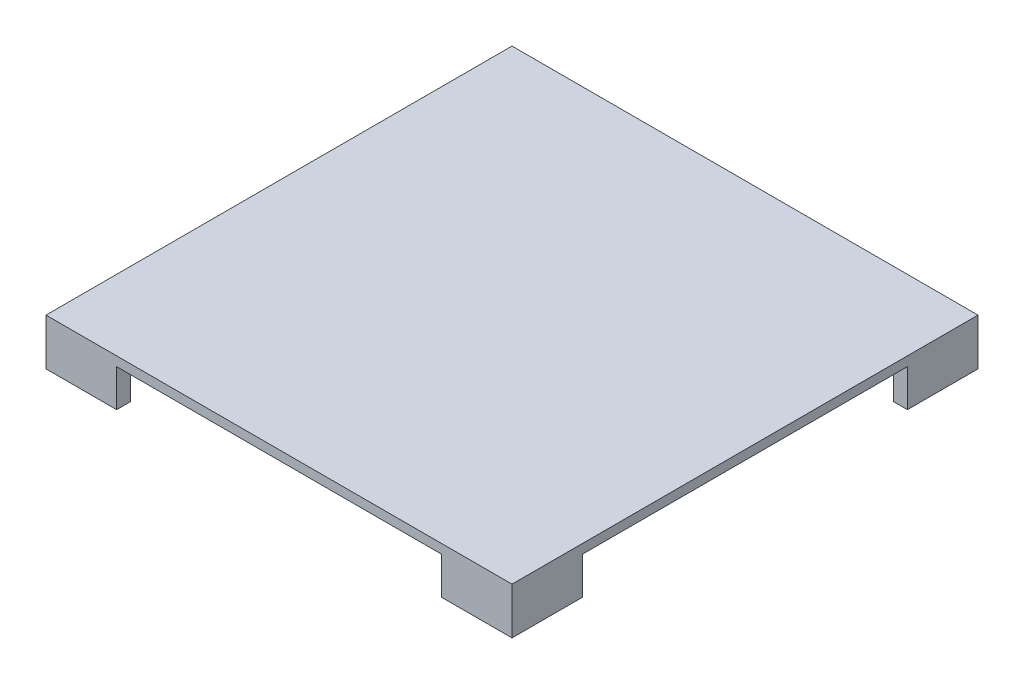
ISO-10303-21;
HEADER;
FILE_DESCRIPTION(('STEP AP214'),'2;1');
FILE_NAME('part.step','',(''),(''),'','','');
FILE_SCHEMA(('AUTOMOTIVE_DESIGN { 1 0 10303 214 1 1 1 1 }'));
ENDSEC;
DATA;
#1=APPLICATION_CONTEXT('core data for automotive mechanical design processes');
#2=APPLICATION_PROTOCOL_DEFINITION('international standard','automotive_design',2000,#1);
#3=PRODUCT_CONTEXT('',#1,'mechanical');
#4=PRODUCT('Part','Part','',(#3));
#5=PRODUCT_RELATED_PRODUCT_CATEGORY('part','',(#4));
#6=PRODUCT_DEFINITION_FORMATION('','',#4);
#7=PRODUCT_DEFINITION_CONTEXT('part definition',#1,'design');
#8=PRODUCT_DEFINITION('design','',#6,#7);
#9=PRODUCT_DEFINITION_SHAPE('','',#8);
#10=(LENGTH_UNIT() NAMED_UNIT(*) SI_UNIT(.MILLI.,.METRE.));
#11=(NAMED_UNIT(*) PLANE_ANGLE_UNIT() SI_UNIT($,.RADIAN.));
#12=(NAMED_UNIT(*) SI_UNIT($,.STERADIAN.) SOLID_ANGLE_UNIT());
#13=UNCERTAINTY_MEASURE_WITH_UNIT(LENGTH_MEASURE(1.E-05),#10,'distance_accuracy_value','');
#14=(GEOMETRIC_REPRESENTATION_CONTEXT(3) GLOBAL_UNCERTAINTY_ASSIGNED_CONTEXT((#13)) GLOBAL_UNIT_ASSIGNED_CONTEXT((#10,
#11,#12)) REPRESENTATION_CONTEXT('',''));
#15=CARTESIAN_POINT('',(0.,0.,0.));
#16=DIRECTION('',(0.,0.,1.));
#17=DIRECTION('',(1.,0.,0.));
#18=AXIS2_PLACEMENT_3D('',#15,#16,#17);
#19=CARTESIAN_POINT('',(0.,0.,0.));
#20=DIRECTION('',(0.,1.,0.));
#21=DIRECTION('',(0.,0.,1.));
#22=AXIS2_PLACEMENT_3D('',#19,#20,#21);
#23=PLANE('',#22);
#24=DIRECTION('',(0.,0.,-1.));
#25=VECTOR('',#24,1.);
#26=CARTESIAN_POINT('',(174.250613401321,0.,0.));
#27=LINE('',#26,#25);
#28=CARTESIAN_POINT('',(174.250613401321,0.,250.));
#29=VERTEX_POINT('',#28);
#30=CARTESIAN_POINT('',(174.250613401321,0.,235.));
#31=VERTEX_POINT('',#30);
#32=EDGE_CURVE('E231',#29,#31,#27,.T.);
#33=ORIENTED_EDGE('',*,*,#32,.F.);
#34=DIRECTION('',(1.,0.,0.));
#35=VECTOR('',#34,1.);
#36=CARTESIAN_POINT('',(0.,0.,250.));
#37=LINE('',#36,#35);
#38=CARTESIAN_POINT('',(-174.250613401321,0.,250.));
#39=VERTEX_POINT('',#38);
#40=EDGE_CURVE('E201',#39,#29,#37,.T.);
#41=ORIENTED_EDGE('',*,*,#40,.F.);
#42=DIRECTION('',(0.,0.,-1.));
#43=VECTOR('',#42,1.);
#44=CARTESIAN_POINT('',(-174.250613401321,0.,0.));
#45=LINE('',#44,#43);
#46=CARTESIAN_POINT('',(-174.250613401321,0.,235.));
#47=VERTEX_POINT('',#46);
#48=EDGE_CURVE('E303',#39,#47,#45,.T.);
#49=ORIENTED_EDGE('',*,*,#48,.T.);
#50=DIRECTION('',(1.,0.,0.));
#51=VECTOR('',#50,1.);
#52=CARTESIAN_POINT('',(1.07368331350599E-13,0.,235.));
#53=LINE('',#52,#51);
#54=CARTESIAN_POINT('',(-235.000000000002,0.,235.));
#55=VERTEX_POINT('',#54);
#56=EDGE_CURVE('E305',#55,#47,#53,.T.);
#57=ORIENTED_EDGE('',*,*,#56,.F.);
#58=DIRECTION('',(0.,0.,-1.));
#59=VECTOR('',#58,1.);
#60=CARTESIAN_POINT('',(-235.000000000002,0.,0.));
#61=LINE('',#60,#59);
#62=CARTESIAN_POINT('',(-235.000000000002,0.,174.250613401319));
#63=VERTEX_POINT('',#62);
#64=EDGE_CURVE('E287',#55,#63,#61,.T.);
#65=ORIENTED_EDGE('',*,*,#64,.T.);
#66=DIRECTION('',(1.,0.,0.));
#67=VECTOR('',#66,1.);
#68=CARTESIAN_POINT('',(0.,0.,174.250613401319));
#69=LINE('',#68,#67);
#70=CARTESIAN_POINT('',(-250.000000000002,0.,174.250613401319));
#71=VERTEX_POINT('',#70);
#72=EDGE_CURVE('E272',#71,#63,#69,.T.);
#73=ORIENTED_EDGE('',*,*,#72,.F.);
#74=DIRECTION('',(0.,0.,-1.));
#75=VECTOR('',#74,1.);
#76=CARTESIAN_POINT('',(-250.000000000002,0.,0.));
#77=LINE('',#76,#75);
#78=CARTESIAN_POINT('',(-250.000000000002,0.,-174.250613401319));
#79=VERTEX_POINT('',#78);
#80=EDGE_CURVE('E366',#71,#79,#77,.T.);
#81=ORIENTED_EDGE('',*,*,#80,.T.);
#82=DIRECTION('',(1.,0.,0.));
#83=VECTOR('',#82,1.);
#84=CARTESIAN_POINT('',(0.,0.,-174.250613401319));
#85=LINE('',#84,#83);
#86=CARTESIAN_POINT('',(-235.000000000002,0.,-174.250613401319));
#87=VERTEX_POINT('',#86);
#88=EDGE_CURVE('E58',#79,#87,#85,.T.);
#89=ORIENTED_EDGE('',*,*,#88,.T.);
#90=DIRECTION('',(0.,0.,1.));
#91=VECTOR('',#90,1.);
#92=CARTESIAN_POINT('',(-235.000000000002,0.,0.));
#93=LINE('',#92,#91);
#94=CARTESIAN_POINT('',(-235.000000000002,0.,-235.));
#95=VERTEX_POINT('',#94);
#96=EDGE_CURVE('E240',#95,#87,#93,.T.);
#97=ORIENTED_EDGE('',*,*,#96,.F.);
#98=DIRECTION('',(1.,0.,0.));
#99=VECTOR('',#98,1.);
#100=CARTESIAN_POINT('',(1.07368331350599E-13,0.,-235.));
#101=LINE('',#100,#99);
#102=CARTESIAN_POINT('',(-174.250613401321,0.,-235.));
#103=VERTEX_POINT('',#102);
#104=EDGE_CURVE('E264',#95,#103,#101,.T.);
#105=ORIENTED_EDGE('',*,*,#104,.T.);
#106=DIRECTION('',(0.,0.,1.));
#107=VECTOR('',#106,1.);
#108=CARTESIAN_POINT('',(-174.250613401321,0.,0.));
#109=LINE('',#108,#107);
#110=CARTESIAN_POINT('',(-174.250613401321,0.,-250.));
#111=VERTEX_POINT('',#110);
#112=EDGE_CURVE('E266',#111,#103,#109,.T.);
#113=ORIENTED_EDGE('',*,*,#112,.F.);
#114=DIRECTION('',(1.,0.,0.));
#115=VECTOR('',#114,1.);
#116=CARTESIAN_POINT('',(0.,0.,-250.));
#117=LINE('',#116,#115);
#118=CARTESIAN_POINT('',(174.250613401321,0.,-250.));
#119=VERTEX_POINT('',#118);
#120=EDGE_CURVE('E378',#111,#119,#117,.T.);
#121=ORIENTED_EDGE('',*,*,#120,.T.);
#122=DIRECTION('',(0.,0.,1.));
#123=VECTOR('',#122,1.);
#124=CARTESIAN_POINT('',(174.250613401321,0.,0.));
#125=LINE('',#124,#123);
#126=CARTESIAN_POINT('',(174.250613401321,0.,-235.));
#127=VERTEX_POINT('',#126);
#128=EDGE_CURVE('E342',#119,#127,#125,.T.);
#129=ORIENTED_EDGE('',*,*,#128,.T.);
#130=DIRECTION('',(-1.,0.,0.));
#131=VECTOR('',#130,1.);
#132=CARTESIAN_POINT('',(-1.07368331350599E-13,0.,-235.));
#133=LINE('',#132,#131);
#134=CARTESIAN_POINT('',(235.000000000002,0.,-235.));
#135=VERTEX_POINT('',#134);
#136=EDGE_CURVE('E345',#135,#127,#133,.T.);
#137=ORIENTED_EDGE('',*,*,#136,.F.);
#138=DIRECTION('',(0.,0.,1.));
#139=VECTOR('',#138,1.);
#140=CARTESIAN_POINT('',(235.000000000002,0.,0.));
#141=LINE('',#140,#139);
#142=CARTESIAN_POINT('',(235.000000000002,0.,-174.250613401319));
#143=VERTEX_POINT('',#142);
#144=EDGE_CURVE('E326',#135,#143,#141,.T.);
#145=ORIENTED_EDGE('',*,*,#144,.T.);
#146=DIRECTION('',(-1.,0.,0.));
#147=VECTOR('',#146,1.);
#148=CARTESIAN_POINT('',(0.,0.,-174.250613401319));
#149=LINE('',#148,#147);
#150=CARTESIAN_POINT('',(250.000000000002,0.,-174.250613401319));
#151=VERTEX_POINT('',#150);
#152=EDGE_CURVE('E312',#151,#143,#149,.T.);
#153=ORIENTED_EDGE('',*,*,#152,.F.);
#154=DIRECTION('',(0.,0.,-1.));
#155=VECTOR('',#154,1.);
#156=CARTESIAN_POINT('',(250.000000000002,0.,0.));
#157=LINE('',#156,#155);
#158=CARTESIAN_POINT('',(250.000000000002,0.,174.250613401319));
#159=VERTEX_POINT('',#158);
#160=EDGE_CURVE('E376',#159,#151,#157,.T.);
#161=ORIENTED_EDGE('',*,*,#160,.F.);
#162=DIRECTION('',(-1.,0.,0.));
#163=VECTOR('',#162,1.);
#164=CARTESIAN_POINT('',(0.,0.,174.250613401319));
#165=LINE('',#164,#163);
#166=CARTESIAN_POINT('',(235.000000000002,0.,174.250613401319));
#167=VERTEX_POINT('',#166);
#168=EDGE_CURVE('E50',#159,#167,#165,.T.);
#169=ORIENTED_EDGE('',*,*,#168,.T.);
#170=DIRECTION('',(0.,0.,-1.));
#171=VECTOR('',#170,1.);
#172=CARTESIAN_POINT('',(235.000000000002,0.,0.));
#173=LINE('',#172,#171);
#174=CARTESIAN_POINT('',(235.000000000002,0.,235.));
#175=VERTEX_POINT('',#174);
#176=EDGE_CURVE('E234',#175,#167,#173,.T.);
#177=ORIENTED_EDGE('',*,*,#176,.F.);
#178=DIRECTION('',(-1.,0.,0.));
#179=VECTOR('',#178,1.);
#180=CARTESIAN_POINT('',(-1.07368331350599E-13,0.,235.));
#181=LINE('',#180,#179);
#182=EDGE_CURVE('E215',#175,#31,#181,.T.);
#183=ORIENTED_EDGE('',*,*,#182,.T.);
#184=EDGE_LOOP('',(#33,#41,#49,#57,#65,#73,#81,#89,#97,#105,#113,#121,#129,#137,#145,#153,#161,
#169,#177,#183));
#185=FACE_BOUND('',#184,.T.);
#186=ADVANCED_FACE('F35',(#185),#23,.F.);
#187=CARTESIAN_POINT('',(0.,10.,250.));
#188=DIRECTION('',(0.,0.,-1.));
#189=DIRECTION('',(-1.,0.,0.));
#190=AXIS2_PLACEMENT_3D('',#187,#188,#189);
#191=PLANE('',#190);
#192=DIRECTION('',(0.,-1.,0.));
#193=VECTOR('',#192,1.);
#194=CARTESIAN_POINT('',(-250.000000000002,10.,250.));
#195=LINE('',#194,#193);
#196=CARTESIAN_POINT('',(-250.000000000002,10.,250.));
#197=VERTEX_POINT('',#196);
#198=CARTESIAN_POINT('',(-250.000000000002,-40.,250.));
#199=VERTEX_POINT('',#198);
#200=EDGE_CURVE('E374',#197,#199,#195,.T.);
#201=ORIENTED_EDGE('',*,*,#200,.T.);
#202=DIRECTION('',(1.,0.,0.));
#203=VECTOR('',#202,1.);
#204=CARTESIAN_POINT('',(0.,-40.,250.));
#205=LINE('',#204,#203);
#206=CARTESIAN_POINT('',(-174.250613401321,-40.,250.));
#207=VERTEX_POINT('',#206);
#208=EDGE_CURVE('E289',#199,#207,#205,.T.);
#209=ORIENTED_EDGE('',*,*,#208,.T.);
#210=DIRECTION('',(0.,1.,0.));
#211=VECTOR('',#210,1.);
#212=CARTESIAN_POINT('',(-174.250613401321,-40.,250.));
#213=LINE('',#212,#211);
#214=EDGE_CURVE('E319',#207,#39,#213,.T.);
#215=ORIENTED_EDGE('',*,*,#214,.T.);
#216=ORIENTED_EDGE('',*,*,#40,.T.);
#217=DIRECTION('',(0.,1.,0.));
#218=VECTOR('',#217,1.);
#219=CARTESIAN_POINT('',(174.250613401321,-40.,250.));
#220=LINE('',#219,#218);
#221=CARTESIAN_POINT('',(174.250613401321,-40.,250.));
#222=VERTEX_POINT('',#221);
#223=EDGE_CURVE('E195',#222,#29,#220,.T.);
#224=ORIENTED_EDGE('',*,*,#223,.F.);
#225=DIRECTION('',(1.,0.,0.));
#226=VECTOR('',#225,1.);
#227=CARTESIAN_POINT('',(0.,-40.,250.));
#228=LINE('',#227,#226);
#229=CARTESIAN_POINT('',(250.000000000002,-40.,250.));
#230=VERTEX_POINT('',#229);
#231=EDGE_CURVE('E199',#222,#230,#228,.T.);
#232=ORIENTED_EDGE('',*,*,#231,.T.);
#233=DIRECTION('',(0.,-1.,0.));
#234=VECTOR('',#233,1.);
#235=CARTESIAN_POINT('',(250.000000000002,10.,250.));
#236=LINE('',#235,#234);
#237=CARTESIAN_POINT('',(250.000000000002,10.,250.));
#238=VERTEX_POINT('',#237);
#239=EDGE_CURVE('E11',#238,#230,#236,.T.);
#240=ORIENTED_EDGE('',*,*,#239,.F.);
#241=DIRECTION('',(1.,0.,0.));
#242=VECTOR('',#241,1.);
#243=CARTESIAN_POINT('',(0.,10.,250.));
#244=LINE('',#243,#242);
#245=EDGE_CURVE('E362',#197,#238,#244,.T.);
#246=ORIENTED_EDGE('',*,*,#245,.F.);
#247=EDGE_LOOP('',(#201,#209,#215,#216,#224,#232,#240,#246));
#248=FACE_BOUND('',#247,.T.);
#249=ADVANCED_FACE('F37',(#248),#191,.F.);
#250=CARTESIAN_POINT('',(250.000000000002,10.,0.));
#251=DIRECTION('',(-1.,0.,0.));
#252=DIRECTION('',(0.,0.,1.));
#253=AXIS2_PLACEMENT_3D('',#250,#251,#252);
#254=PLANE('',#253);
#255=ORIENTED_EDGE('',*,*,#239,.T.);
#256=DIRECTION('',(0.,0.,-1.));
#257=VECTOR('',#256,1.);
#258=CARTESIAN_POINT('',(250.000000000002,-40.,0.));
#259=LINE('',#258,#257);
#260=CARTESIAN_POINT('',(250.000000000002,-40.,174.250613401319));
#261=VERTEX_POINT('',#260);
#262=EDGE_CURVE('E221',#230,#261,#259,.T.);
#263=ORIENTED_EDGE('',*,*,#262,.T.);
#264=DIRECTION('',(0.,1.,0.));
#265=VECTOR('',#264,1.);
#266=CARTESIAN_POINT('',(250.000000000002,-40.,174.250613401319));
#267=LINE('',#266,#265);
#268=EDGE_CURVE('E205',#261,#159,#267,.T.);
#269=ORIENTED_EDGE('',*,*,#268,.T.);
#270=ORIENTED_EDGE('',*,*,#160,.T.);
#271=DIRECTION('',(0.,1.,0.));
#272=VECTOR('',#271,1.);
#273=CARTESIAN_POINT('',(250.000000000002,-40.,-174.250613401319));
#274=LINE('',#273,#272);
#275=CARTESIAN_POINT('',(250.000000000002,-40.,-174.250613401319));
#276=VERTEX_POINT('',#275);
#277=EDGE_CURVE('E340',#276,#151,#274,.T.);
#278=ORIENTED_EDGE('',*,*,#277,.F.);
#279=DIRECTION('',(0.,0.,-1.));
#280=VECTOR('',#279,1.);
#281=CARTESIAN_POINT('',(250.000000000002,-40.,0.));
#282=LINE('',#281,#280);
#283=CARTESIAN_POINT('',(250.000000000002,-40.,-250.));
#284=VERTEX_POINT('',#283);
#285=EDGE_CURVE('E325',#276,#284,#282,.T.);
#286=ORIENTED_EDGE('',*,*,#285,.T.);
#287=DIRECTION('',(0.,-1.,0.));
#288=VECTOR('',#287,1.);
#289=CARTESIAN_POINT('',(250.000000000002,10.,-250.));
#290=LINE('',#289,#288);
#291=CARTESIAN_POINT('',(250.000000000002,10.,-250.));
#292=VERTEX_POINT('',#291);
#293=EDGE_CURVE('E43',#292,#284,#290,.T.);
#294=ORIENTED_EDGE('',*,*,#293,.F.);
#295=DIRECTION('',(0.,0.,-1.));
#296=VECTOR('',#295,1.);
#297=CARTESIAN_POINT('',(250.000000000002,10.,0.));
#298=LINE('',#297,#296);
#299=EDGE_CURVE('E365',#238,#292,#298,.T.);
#300=ORIENTED_EDGE('',*,*,#299,.F.);
#301=EDGE_LOOP('',(#255,#263,#269,#270,#278,#286,#294,#300));
#302=FACE_BOUND('',#301,.T.);
#303=ADVANCED_FACE('F394',(#302),#254,.F.);
#304=CARTESIAN_POINT('',(0.,10.,-250.));
#305=DIRECTION('',(0.,0.,-1.));
#306=DIRECTION('',(-1.,0.,0.));
#307=AXIS2_PLACEMENT_3D('',#304,#305,#306);
#308=PLANE('',#307);
#309=ORIENTED_EDGE('',*,*,#120,.F.);
#310=DIRECTION('',(0.,1.,0.));
#311=VECTOR('',#310,1.);
#312=CARTESIAN_POINT('',(-174.250613401321,-40.,-250.));
#313=LINE('',#312,#311);
#314=CARTESIAN_POINT('',(-174.250613401321,-40.,-250.));
#315=VERTEX_POINT('',#314);
#316=EDGE_CURVE('E276',#315,#111,#313,.T.);
#317=ORIENTED_EDGE('',*,*,#316,.F.);
#318=DIRECTION('',(1.,0.,0.));
#319=VECTOR('',#318,1.);
#320=CARTESIAN_POINT('',(0.,-40.,-250.));
#321=LINE('',#320,#319);
#322=CARTESIAN_POINT('',(-250.000000000002,-40.,-250.));
#323=VERTEX_POINT('',#322);
#324=EDGE_CURVE('E253',#323,#315,#321,.T.);
#325=ORIENTED_EDGE('',*,*,#324,.F.);
#326=DIRECTION('',(0.,-1.,0.));
#327=VECTOR('',#326,1.);
#328=CARTESIAN_POINT('',(-250.000000000002,10.,-250.));
#329=LINE('',#328,#327);
#330=CARTESIAN_POINT('',(-250.000000000002,10.,-250.));
#331=VERTEX_POINT('',#330);
#332=EDGE_CURVE('E382',#331,#323,#329,.T.);
#333=ORIENTED_EDGE('',*,*,#332,.F.);
#334=DIRECTION('',(1.,0.,0.));
#335=VECTOR('',#334,1.);
#336=CARTESIAN_POINT('',(0.,10.,-250.));
#337=LINE('',#336,#335);
#338=EDGE_CURVE('E368',#331,#292,#337,.T.);
#339=ORIENTED_EDGE('',*,*,#338,.T.);
#340=ORIENTED_EDGE('',*,*,#293,.T.);
#341=DIRECTION('',(1.,0.,0.));
#342=VECTOR('',#341,1.);
#343=CARTESIAN_POINT('',(0.,-40.,-250.));
#344=LINE('',#343,#342);
#345=CARTESIAN_POINT('',(174.250613401321,-40.,-250.));
#346=VERTEX_POINT('',#345);
#347=EDGE_CURVE('E329',#346,#284,#344,.T.);
#348=ORIENTED_EDGE('',*,*,#347,.F.);
#349=DIRECTION('',(0.,1.,0.));
#350=VECTOR('',#349,1.);
#351=CARTESIAN_POINT('',(174.250613401321,-40.,-250.));
#352=LINE('',#351,#350);
#353=EDGE_CURVE('E357',#346,#119,#352,.T.);
#354=ORIENTED_EDGE('',*,*,#353,.T.);
#355=EDGE_LOOP('',(#309,#317,#325,#333,#339,#340,#348,#354));
#356=FACE_BOUND('',#355,.T.);
#357=ADVANCED_FACE('F387',(#356),#308,.T.);
#358=CARTESIAN_POINT('',(-250.000000000002,10.,0.));
#359=DIRECTION('',(-1.,0.,0.));
#360=DIRECTION('',(0.,0.,1.));
#361=AXIS2_PLACEMENT_3D('',#358,#359,#360);
#362=PLANE('',#361);
#363=ORIENTED_EDGE('',*,*,#80,.F.);
#364=DIRECTION('',(0.,1.,0.));
#365=VECTOR('',#364,1.);
#366=CARTESIAN_POINT('',(-250.000000000002,-40.,174.250613401319));
#367=LINE('',#366,#365);
#368=CARTESIAN_POINT('',(-250.000000000002,-40.,174.250613401319));
#369=VERTEX_POINT('',#368);
#370=EDGE_CURVE('E300',#369,#71,#367,.T.);
#371=ORIENTED_EDGE('',*,*,#370,.F.);
#372=DIRECTION('',(0.,0.,-1.));
#373=VECTOR('',#372,1.);
#374=CARTESIAN_POINT('',(-250.000000000002,-40.,0.));
#375=LINE('',#374,#373);
#376=EDGE_CURVE('E286',#199,#369,#375,.T.);
#377=ORIENTED_EDGE('',*,*,#376,.F.);
#378=ORIENTED_EDGE('',*,*,#200,.F.);
#379=DIRECTION('',(0.,0.,-1.));
#380=VECTOR('',#379,1.);
#381=CARTESIAN_POINT('',(-250.000000000002,10.,0.));
#382=LINE('',#381,#380);
#383=EDGE_CURVE('E371',#197,#331,#382,.T.);
#384=ORIENTED_EDGE('',*,*,#383,.T.);
#385=ORIENTED_EDGE('',*,*,#332,.T.);
#386=DIRECTION('',(0.,0.,-1.));
#387=VECTOR('',#386,1.);
#388=CARTESIAN_POINT('',(-250.000000000002,-40.,0.));
#389=LINE('',#388,#387);
#390=CARTESIAN_POINT('',(-250.000000000002,-40.,-174.250613401319));
#391=VERTEX_POINT('',#390);
#392=EDGE_CURVE('E255',#391,#323,#389,.T.);
#393=ORIENTED_EDGE('',*,*,#392,.F.);
#394=DIRECTION('',(0.,1.,0.));
#395=VECTOR('',#394,1.);
#396=CARTESIAN_POINT('',(-250.000000000002,-40.,-174.250613401319));
#397=LINE('',#396,#395);
#398=EDGE_CURVE('E273',#391,#79,#397,.T.);
#399=ORIENTED_EDGE('',*,*,#398,.T.);
#400=EDGE_LOOP('',(#363,#371,#377,#378,#384,#385,#393,#399));
#401=FACE_BOUND('',#400,.T.);
#402=ADVANCED_FACE('F428',(#401),#362,.T.);
#403=CARTESIAN_POINT('',(0.,10.,0.));
#404=DIRECTION('',(0.,1.,0.));
#405=DIRECTION('',(0.,0.,1.));
#406=AXIS2_PLACEMENT_3D('',#403,#404,#405);
#407=PLANE('',#406);
#408=ORIENTED_EDGE('',*,*,#245,.T.);
#409=ORIENTED_EDGE('',*,*,#299,.T.);
#410=ORIENTED_EDGE('',*,*,#338,.F.);
#411=ORIENTED_EDGE('',*,*,#383,.F.);
#412=EDGE_LOOP('',(#408,#409,#410,#411));
#413=FACE_BOUND('',#412,.T.);
#414=ADVANCED_FACE('F427',(#413),#407,.T.);
#415=CARTESIAN_POINT('',(0.,-40.,-174.250613401319));
#416=DIRECTION('',(0.,0.,-1.));
#417=DIRECTION('',(-1.,0.,0.));
#418=AXIS2_PLACEMENT_3D('',#415,#416,#417);
#419=PLANE('',#418);
#420=ORIENTED_EDGE('',*,*,#152,.T.);
#421=DIRECTION('',(0.,1.,0.));
#422=VECTOR('',#421,1.);
#423=CARTESIAN_POINT('',(235.000000000002,-40.,-174.250613401319));
#424=LINE('',#423,#422);
#425=CARTESIAN_POINT('',(235.000000000002,-40.,-174.250613401319));
#426=VERTEX_POINT('',#425);
#427=EDGE_CURVE('E350',#426,#143,#424,.T.);
#428=ORIENTED_EDGE('',*,*,#427,.F.);
#429=DIRECTION('',(-1.,0.,0.));
#430=VECTOR('',#429,1.);
#431=CARTESIAN_POINT('',(0.,-40.,-174.250613401319));
#432=LINE('',#431,#430);
#433=EDGE_CURVE('E323',#276,#426,#432,.T.);
#434=ORIENTED_EDGE('',*,*,#433,.F.);
#435=ORIENTED_EDGE('',*,*,#277,.T.);
#436=EDGE_LOOP('',(#420,#428,#434,#435));
#437=FACE_BOUND('',#436,.T.);
#438=ADVANCED_FACE('F400',(#437),#419,.F.);
#439=CARTESIAN_POINT('',(235.000000000002,-40.,0.));
#440=DIRECTION('',(-1.,0.,0.));
#441=DIRECTION('',(0.,0.,1.));
#442=AXIS2_PLACEMENT_3D('',#439,#440,#441);
#443=PLANE('',#442);
#444=ORIENTED_EDGE('',*,*,#144,.F.);
#445=DIRECTION('',(0.,1.,0.));
#446=VECTOR('',#445,1.);
#447=CARTESIAN_POINT('',(235.000000000002,-40.,-235.));
#448=LINE('',#447,#446);
#449=CARTESIAN_POINT('',(235.000000000002,-40.,-235.));
#450=VERTEX_POINT('',#449);
#451=EDGE_CURVE('E353',#450,#135,#448,.T.);
#452=ORIENTED_EDGE('',*,*,#451,.F.);
#453=DIRECTION('',(0.,0.,1.));
#454=VECTOR('',#453,1.);
#455=CARTESIAN_POINT('',(235.000000000002,-40.,0.));
#456=LINE('',#455,#454);
#457=EDGE_CURVE('E337',#450,#426,#456,.T.);
#458=ORIENTED_EDGE('',*,*,#457,.T.);
#459=ORIENTED_EDGE('',*,*,#427,.T.);
#460=EDGE_LOOP('',(#444,#452,#458,#459));
#461=FACE_BOUND('',#460,.T.);
#462=ADVANCED_FACE('F406',(#461),#443,.T.);
#463=CARTESIAN_POINT('',(-1.07368331350599E-13,-40.,-235.));
#464=DIRECTION('',(0.,0.,-1.));
#465=DIRECTION('',(-1.,0.,0.));
#466=AXIS2_PLACEMENT_3D('',#463,#464,#465);
#467=PLANE('',#466);
#468=ORIENTED_EDGE('',*,*,#136,.T.);
#469=DIRECTION('',(0.,1.,0.));
#470=VECTOR('',#469,1.);
#471=CARTESIAN_POINT('',(174.250613401321,-40.,-235.));
#472=LINE('',#471,#470);
#473=CARTESIAN_POINT('',(174.250613401321,-40.,-235.));
#474=VERTEX_POINT('',#473);
#475=EDGE_CURVE('E355',#474,#127,#472,.T.);
#476=ORIENTED_EDGE('',*,*,#475,.F.);
#477=DIRECTION('',(-1.,0.,0.));
#478=VECTOR('',#477,1.);
#479=CARTESIAN_POINT('',(-1.07368331350599E-13,-40.,-235.));
#480=LINE('',#479,#478);
#481=EDGE_CURVE('E335',#450,#474,#480,.T.);
#482=ORIENTED_EDGE('',*,*,#481,.F.);
#483=ORIENTED_EDGE('',*,*,#451,.T.);
#484=EDGE_LOOP('',(#468,#476,#482,#483));
#485=FACE_BOUND('',#484,.T.);
#486=ADVANCED_FACE('F409',(#485),#467,.F.);
#487=CARTESIAN_POINT('',(174.250613401321,-40.,0.));
#488=DIRECTION('',(-1.,0.,0.));
#489=DIRECTION('',(0.,0.,1.));
#490=AXIS2_PLACEMENT_3D('',#487,#488,#489);
#491=PLANE('',#490);
#492=ORIENTED_EDGE('',*,*,#128,.F.);
#493=ORIENTED_EDGE('',*,*,#353,.F.);
#494=DIRECTION('',(0.,0.,1.));
#495=VECTOR('',#494,1.);
#496=CARTESIAN_POINT('',(174.250613401321,-40.,0.));
#497=LINE('',#496,#495);
#498=EDGE_CURVE('E332',#346,#474,#497,.T.);
#499=ORIENTED_EDGE('',*,*,#498,.T.);
#500=ORIENTED_EDGE('',*,*,#475,.T.);
#501=EDGE_LOOP('',(#492,#493,#499,#500));
#502=FACE_BOUND('',#501,.T.);
#503=ADVANCED_FACE('F412',(#502),#491,.T.);
#504=CARTESIAN_POINT('',(0.,-40.,0.));
#505=DIRECTION('',(0.,1.,0.));
#506=DIRECTION('',(0.,0.,1.));
#507=AXIS2_PLACEMENT_3D('',#504,#505,#506);
#508=PLANE('',#507);
#509=ORIENTED_EDGE('',*,*,#433,.T.);
#510=ORIENTED_EDGE('',*,*,#457,.F.);
#511=ORIENTED_EDGE('',*,*,#481,.T.);
#512=ORIENTED_EDGE('',*,*,#498,.F.);
#513=ORIENTED_EDGE('',*,*,#347,.T.);
#514=ORIENTED_EDGE('',*,*,#285,.F.);
#515=EDGE_LOOP('',(#509,#510,#511,#512,#513,#514));
#516=FACE_BOUND('',#515,.T.);
#517=ADVANCED_FACE('F393',(#516),#508,.F.);
#518=CARTESIAN_POINT('',(0.,-40.,174.250613401319));
#519=DIRECTION('',(0.,0.,1.));
#520=DIRECTION('',(1.,0.,0.));
#521=AXIS2_PLACEMENT_3D('',#518,#519,#520);
#522=PLANE('',#521);
#523=ORIENTED_EDGE('',*,*,#72,.T.);
#524=DIRECTION('',(0.,1.,0.));
#525=VECTOR('',#524,1.);
#526=CARTESIAN_POINT('',(-235.000000000002,-40.,174.250613401319));
#527=LINE('',#526,#525);
#528=CARTESIAN_POINT('',(-235.000000000002,-40.,174.250613401319));
#529=VERTEX_POINT('',#528);
#530=EDGE_CURVE('E309',#529,#63,#527,.T.);
#531=ORIENTED_EDGE('',*,*,#530,.F.);
#532=DIRECTION('',(1.,0.,0.));
#533=VECTOR('',#532,1.);
#534=CARTESIAN_POINT('',(0.,-40.,174.250613401319));
#535=LINE('',#534,#533);
#536=EDGE_CURVE('E284',#369,#529,#535,.T.);
#537=ORIENTED_EDGE('',*,*,#536,.F.);
#538=ORIENTED_EDGE('',*,*,#370,.T.);
#539=EDGE_LOOP('',(#523,#531,#537,#538));
#540=FACE_BOUND('',#539,.T.);
#541=ADVANCED_FACE('F457',(#540),#522,.F.);
#542=CARTESIAN_POINT('',(-235.000000000002,-40.,0.));
#543=DIRECTION('',(1.,0.,0.));
#544=DIRECTION('',(0.,0.,-1.));
#545=AXIS2_PLACEMENT_3D('',#542,#543,#544);
#546=PLANE('',#545);
#547=ORIENTED_EDGE('',*,*,#64,.F.);
#548=DIRECTION('',(0.,1.,0.));
#549=VECTOR('',#548,1.);
#550=CARTESIAN_POINT('',(-235.000000000002,-40.,235.));
#551=LINE('',#550,#549);
#552=CARTESIAN_POINT('',(-235.000000000002,-40.,235.));
#553=VERTEX_POINT('',#552);
#554=EDGE_CURVE('E313',#553,#55,#551,.T.);
#555=ORIENTED_EDGE('',*,*,#554,.F.);
#556=DIRECTION('',(0.,0.,-1.));
#557=VECTOR('',#556,1.);
#558=CARTESIAN_POINT('',(-235.000000000002,-40.,0.));
#559=LINE('',#558,#557);
#560=EDGE_CURVE('E297',#553,#529,#559,.T.);
#561=ORIENTED_EDGE('',*,*,#560,.T.);
#562=ORIENTED_EDGE('',*,*,#530,.T.);
#563=EDGE_LOOP('',(#547,#555,#561,#562));
#564=FACE_BOUND('',#563,.T.);
#565=ADVANCED_FACE('F453',(#564),#546,.T.);
#566=CARTESIAN_POINT('',(1.07368331350599E-13,-40.,235.));
#567=DIRECTION('',(0.,0.,1.));
#568=DIRECTION('',(1.,0.,0.));
#569=AXIS2_PLACEMENT_3D('',#566,#567,#568);
#570=PLANE('',#569);
#571=ORIENTED_EDGE('',*,*,#56,.T.);
#572=DIRECTION('',(0.,1.,0.));
#573=VECTOR('',#572,1.);
#574=CARTESIAN_POINT('',(-174.250613401321,-40.,235.));
#575=LINE('',#574,#573);
#576=CARTESIAN_POINT('',(-174.250613401321,-40.,235.));
#577=VERTEX_POINT('',#576);
#578=EDGE_CURVE('E316',#577,#47,#575,.T.);
#579=ORIENTED_EDGE('',*,*,#578,.F.);
#580=DIRECTION('',(1.,0.,0.));
#581=VECTOR('',#580,1.);
#582=CARTESIAN_POINT('',(1.07368331350599E-13,-40.,235.));
#583=LINE('',#582,#581);
#584=EDGE_CURVE('E295',#553,#577,#583,.T.);
#585=ORIENTED_EDGE('',*,*,#584,.F.);
#586=ORIENTED_EDGE('',*,*,#554,.T.);
#587=EDGE_LOOP('',(#571,#579,#585,#586));
#588=FACE_BOUND('',#587,.T.);
#589=ADVANCED_FACE('F448',(#588),#570,.F.);
#590=CARTESIAN_POINT('',(-174.250613401321,-40.,0.));
#591=DIRECTION('',(1.,0.,0.));
#592=DIRECTION('',(0.,0.,-1.));
#593=AXIS2_PLACEMENT_3D('',#590,#591,#592);
#594=PLANE('',#593);
#595=ORIENTED_EDGE('',*,*,#48,.F.);
#596=ORIENTED_EDGE('',*,*,#214,.F.);
#597=DIRECTION('',(0.,0.,-1.));
#598=VECTOR('',#597,1.);
#599=CARTESIAN_POINT('',(-174.250613401321,-40.,0.));
#600=LINE('',#599,#598);
#601=EDGE_CURVE('E292',#207,#577,#600,.T.);
#602=ORIENTED_EDGE('',*,*,#601,.T.);
#603=ORIENTED_EDGE('',*,*,#578,.T.);
#604=EDGE_LOOP('',(#595,#596,#602,#603));
#605=FACE_BOUND('',#604,.T.);
#606=ADVANCED_FACE('F444',(#605),#594,.T.);
#607=CARTESIAN_POINT('',(0.,-40.,0.));
#608=DIRECTION('',(0.,1.,0.));
#609=DIRECTION('',(0.,0.,1.));
#610=AXIS2_PLACEMENT_3D('',#607,#608,#609);
#611=PLANE('',#610);
#612=ORIENTED_EDGE('',*,*,#536,.T.);
#613=ORIENTED_EDGE('',*,*,#560,.F.);
#614=ORIENTED_EDGE('',*,*,#584,.T.);
#615=ORIENTED_EDGE('',*,*,#601,.F.);
#616=ORIENTED_EDGE('',*,*,#208,.F.);
#617=ORIENTED_EDGE('',*,*,#376,.T.);
#618=EDGE_LOOP('',(#612,#613,#614,#615,#616,#617));
#619=FACE_BOUND('',#618,.T.);
#620=ADVANCED_FACE('F558',(#619),#611,.F.);
#621=CARTESIAN_POINT('',(-235.000000000002,-40.,0.));
#622=DIRECTION('',(-1.,0.,0.));
#623=DIRECTION('',(0.,0.,1.));
#624=AXIS2_PLACEMENT_3D('',#621,#622,#623);
#625=PLANE('',#624);
#626=ORIENTED_EDGE('',*,*,#96,.T.);
#627=DIRECTION('',(0.,1.,0.));
#628=VECTOR('',#627,1.);
#629=CARTESIAN_POINT('',(-235.000000000002,-40.,-174.250613401319));
#630=LINE('',#629,#628);
#631=CARTESIAN_POINT('',(-235.000000000002,-40.,-174.250613401319));
#632=VERTEX_POINT('',#631);
#633=EDGE_CURVE('E270',#632,#87,#630,.T.);
#634=ORIENTED_EDGE('',*,*,#633,.F.);
#635=DIRECTION('',(0.,0.,1.));
#636=VECTOR('',#635,1.);
#637=CARTESIAN_POINT('',(-235.000000000002,-40.,0.));
#638=LINE('',#637,#636);
#639=CARTESIAN_POINT('',(-235.000000000002,-40.,-235.));
#640=VERTEX_POINT('',#639);
#641=EDGE_CURVE('E246',#640,#632,#638,.T.);
#642=ORIENTED_EDGE('',*,*,#641,.F.);
#643=DIRECTION('',(0.,1.,0.));
#644=VECTOR('',#643,1.);
#645=CARTESIAN_POINT('',(-235.000000000002,-40.,-235.));
#646=LINE('',#645,#644);
#647=EDGE_CURVE('E261',#640,#95,#646,.T.);
#648=ORIENTED_EDGE('',*,*,#647,.T.);
#649=EDGE_LOOP('',(#626,#634,#642,#648));
#650=FACE_BOUND('',#649,.T.);
#651=ADVANCED_FACE('F463',(#650),#625,.F.);
#652=CARTESIAN_POINT('',(0.,-40.,-174.250613401319));
#653=DIRECTION('',(0.,0.,1.));
#654=DIRECTION('',(1.,0.,0.));
#655=AXIS2_PLACEMENT_3D('',#652,#653,#654);
#656=PLANE('',#655);
#657=ORIENTED_EDGE('',*,*,#88,.F.);
#658=ORIENTED_EDGE('',*,*,#398,.F.);
#659=DIRECTION('',(1.,0.,0.));
#660=VECTOR('',#659,1.);
#661=CARTESIAN_POINT('',(0.,-40.,-174.250613401319));
#662=LINE('',#661,#660);
#663=EDGE_CURVE('E258',#391,#632,#662,.T.);
#664=ORIENTED_EDGE('',*,*,#663,.T.);
#665=ORIENTED_EDGE('',*,*,#633,.T.);
#666=EDGE_LOOP('',(#657,#658,#664,#665));
#667=FACE_BOUND('',#666,.T.);
#668=ADVANCED_FACE('F459',(#667),#656,.T.);
#669=CARTESIAN_POINT('',(-174.250613401321,-40.,0.));
#670=DIRECTION('',(-1.,0.,0.));
#671=DIRECTION('',(0.,0.,1.));
#672=AXIS2_PLACEMENT_3D('',#669,#670,#671);
#673=PLANE('',#672);
#674=ORIENTED_EDGE('',*,*,#112,.T.);
#675=DIRECTION('',(0.,1.,0.));
#676=VECTOR('',#675,1.);
#677=CARTESIAN_POINT('',(-174.250613401321,-40.,-235.));
#678=LINE('',#677,#676);
#679=CARTESIAN_POINT('',(-174.250613401321,-40.,-235.));
#680=VERTEX_POINT('',#679);
#681=EDGE_CURVE('E279',#680,#103,#678,.T.);
#682=ORIENTED_EDGE('',*,*,#681,.F.);
#683=DIRECTION('',(0.,0.,1.));
#684=VECTOR('',#683,1.);
#685=CARTESIAN_POINT('',(-174.250613401321,-40.,0.));
#686=LINE('',#685,#684);
#687=EDGE_CURVE('E251',#315,#680,#686,.T.);
#688=ORIENTED_EDGE('',*,*,#687,.F.);
#689=ORIENTED_EDGE('',*,*,#316,.T.);
#690=EDGE_LOOP('',(#674,#682,#688,#689));
#691=FACE_BOUND('',#690,.T.);
#692=ADVANCED_FACE('F417',(#691),#673,.F.);
#693=CARTESIAN_POINT('',(1.07368331350599E-13,-40.,-235.));
#694=DIRECTION('',(0.,0.,1.));
#695=DIRECTION('',(1.,0.,0.));
#696=AXIS2_PLACEMENT_3D('',#693,#694,#695);
#697=PLANE('',#696);
#698=ORIENTED_EDGE('',*,*,#104,.F.);
#699=ORIENTED_EDGE('',*,*,#647,.F.);
#700=DIRECTION('',(1.,0.,0.));
#701=VECTOR('',#700,1.);
#702=CARTESIAN_POINT('',(1.07368331350599E-13,-40.,-235.));
#703=LINE('',#702,#701);
#704=EDGE_CURVE('E248',#640,#680,#703,.T.);
#705=ORIENTED_EDGE('',*,*,#704,.T.);
#706=ORIENTED_EDGE('',*,*,#681,.T.);
#707=EDGE_LOOP('',(#698,#699,#705,#706));
#708=FACE_BOUND('',#707,.T.);
#709=ADVANCED_FACE('F466',(#708),#697,.T.);
#710=CARTESIAN_POINT('',(0.,-40.,0.));
#711=DIRECTION('',(0.,1.,0.));
#712=DIRECTION('',(0.,0.,1.));
#713=AXIS2_PLACEMENT_3D('',#710,#711,#712);
#714=PLANE('',#713);
#715=ORIENTED_EDGE('',*,*,#641,.T.);
#716=ORIENTED_EDGE('',*,*,#663,.F.);
#717=ORIENTED_EDGE('',*,*,#392,.T.);
#718=ORIENTED_EDGE('',*,*,#324,.T.);
#719=ORIENTED_EDGE('',*,*,#687,.T.);
#720=ORIENTED_EDGE('',*,*,#704,.F.);
#721=EDGE_LOOP('',(#715,#716,#717,#718,#719,#720));
#722=FACE_BOUND('',#721,.T.);
#723=ADVANCED_FACE('F421',(#722),#714,.F.);
#724=CARTESIAN_POINT('',(174.250613401321,-40.,0.));
#725=DIRECTION('',(1.,0.,0.));
#726=DIRECTION('',(0.,0.,-1.));
#727=AXIS2_PLACEMENT_3D('',#724,#725,#726);
#728=PLANE('',#727);
#729=ORIENTED_EDGE('',*,*,#32,.T.);
#730=DIRECTION('',(0.,1.,0.));
#731=VECTOR('',#730,1.);
#732=CARTESIAN_POINT('',(174.250613401321,-40.,235.));
#733=LINE('',#732,#731);
#734=CARTESIAN_POINT('',(174.250613401321,-40.,235.));
#735=VERTEX_POINT('',#734);
#736=EDGE_CURVE('E211',#735,#31,#733,.T.);
#737=ORIENTED_EDGE('',*,*,#736,.F.);
#738=DIRECTION('',(0.,0.,-1.));
#739=VECTOR('',#738,1.);
#740=CARTESIAN_POINT('',(174.250613401321,-40.,0.));
#741=LINE('',#740,#739);
#742=EDGE_CURVE('E209',#222,#735,#741,.T.);
#743=ORIENTED_EDGE('',*,*,#742,.F.);
#744=ORIENTED_EDGE('',*,*,#223,.T.);
#745=EDGE_LOOP('',(#729,#737,#743,#744));
#746=FACE_BOUND('',#745,.T.);
#747=ADVANCED_FACE('F210',(#746),#728,.F.);
#748=CARTESIAN_POINT('',(-1.07368331350599E-13,-40.,235.));
#749=DIRECTION('',(0.,0.,-1.));
#750=DIRECTION('',(-1.,0.,0.));
#751=AXIS2_PLACEMENT_3D('',#748,#749,#750);
#752=PLANE('',#751);
#753=ORIENTED_EDGE('',*,*,#182,.F.);
#754=DIRECTION('',(0.,1.,0.));
#755=VECTOR('',#754,1.);
#756=CARTESIAN_POINT('',(235.000000000002,-40.,235.));
#757=LINE('',#756,#755);
#758=CARTESIAN_POINT('',(235.000000000002,-40.,235.));
#759=VERTEX_POINT('',#758);
#760=EDGE_CURVE('E241',#759,#175,#757,.T.);
#761=ORIENTED_EDGE('',*,*,#760,.F.);
#762=DIRECTION('',(-1.,0.,0.));
#763=VECTOR('',#762,1.);
#764=CARTESIAN_POINT('',(-1.07368331350599E-13,-40.,235.));
#765=LINE('',#764,#763);
#766=EDGE_CURVE('E206',#759,#735,#765,.T.);
#767=ORIENTED_EDGE('',*,*,#766,.T.);
#768=ORIENTED_EDGE('',*,*,#736,.T.);
#769=EDGE_LOOP('',(#753,#761,#767,#768));
#770=FACE_BOUND('',#769,.T.);
#771=ADVANCED_FACE('F440',(#770),#752,.T.);
#772=CARTESIAN_POINT('',(235.000000000002,-40.,0.));
#773=DIRECTION('',(1.,0.,0.));
#774=DIRECTION('',(0.,0.,-1.));
#775=AXIS2_PLACEMENT_3D('',#772,#773,#774);
#776=PLANE('',#775);
#777=ORIENTED_EDGE('',*,*,#176,.T.);
#778=DIRECTION('',(0.,1.,0.));
#779=VECTOR('',#778,1.);
#780=CARTESIAN_POINT('',(235.000000000002,-40.,174.250613401319));
#781=LINE('',#780,#779);
#782=CARTESIAN_POINT('',(235.000000000002,-40.,174.250613401319));
#783=VERTEX_POINT('',#782);
#784=EDGE_CURVE('E243',#783,#167,#781,.T.);
#785=ORIENTED_EDGE('',*,*,#784,.F.);
#786=DIRECTION('',(0.,0.,-1.));
#787=VECTOR('',#786,1.);
#788=CARTESIAN_POINT('',(235.000000000002,-40.,0.));
#789=LINE('',#788,#787);
#790=EDGE_CURVE('E228',#759,#783,#789,.T.);
#791=ORIENTED_EDGE('',*,*,#790,.F.);
#792=ORIENTED_EDGE('',*,*,#760,.T.);
#793=EDGE_LOOP('',(#777,#785,#791,#792));
#794=FACE_BOUND('',#793,.T.);
#795=ADVANCED_FACE('F437',(#794),#776,.F.);
#796=CARTESIAN_POINT('',(0.,-40.,174.250613401319));
#797=DIRECTION('',(0.,0.,-1.));
#798=DIRECTION('',(-1.,0.,0.));
#799=AXIS2_PLACEMENT_3D('',#796,#797,#798);
#800=PLANE('',#799);
#801=ORIENTED_EDGE('',*,*,#168,.F.);
#802=ORIENTED_EDGE('',*,*,#268,.F.);
#803=DIRECTION('',(-1.,0.,0.));
#804=VECTOR('',#803,1.);
#805=CARTESIAN_POINT('',(0.,-40.,174.250613401319));
#806=LINE('',#805,#804);
#807=EDGE_CURVE('E223',#261,#783,#806,.T.);
#808=ORIENTED_EDGE('',*,*,#807,.T.);
#809=ORIENTED_EDGE('',*,*,#784,.T.);
#810=EDGE_LOOP('',(#801,#802,#808,#809));
#811=FACE_BOUND('',#810,.T.);
#812=ADVANCED_FACE('F616',(#811),#800,.T.);
#813=CARTESIAN_POINT('',(0.,-40.,0.));
#814=DIRECTION('',(0.,1.,0.));
#815=DIRECTION('',(0.,0.,1.));
#816=AXIS2_PLACEMENT_3D('',#813,#814,#815);
#817=PLANE('',#816);
#818=ORIENTED_EDGE('',*,*,#742,.T.);
#819=ORIENTED_EDGE('',*,*,#766,.F.);
#820=ORIENTED_EDGE('',*,*,#790,.T.);
#821=ORIENTED_EDGE('',*,*,#807,.F.);
#822=ORIENTED_EDGE('',*,*,#262,.F.);
#823=ORIENTED_EDGE('',*,*,#231,.F.);
#824=EDGE_LOOP('',(#818,#819,#820,#821,#822,#823));
#825=FACE_BOUND('',#824,.T.);
#826=ADVANCED_FACE('F218',(#825),#817,.F.);
#827=CLOSED_SHELL('',(#186,#249,#303,#357,#402,#414,#438,#462,#486,#503,#517,#541,#565,#589,
#606,#620,#651,#668,#692,#709,#723,#747,#771,#795,#812,#826));
#828=MANIFOLD_SOLID_BREP('B2',#827);
#829=ADVANCED_BREP_SHAPE_REPRESENTATION('',(#18,#828),#14);
#830=SHAPE_DEFINITION_REPRESENTATION(#9,#829);
ENDSEC;
END-ISO-10303-21;
